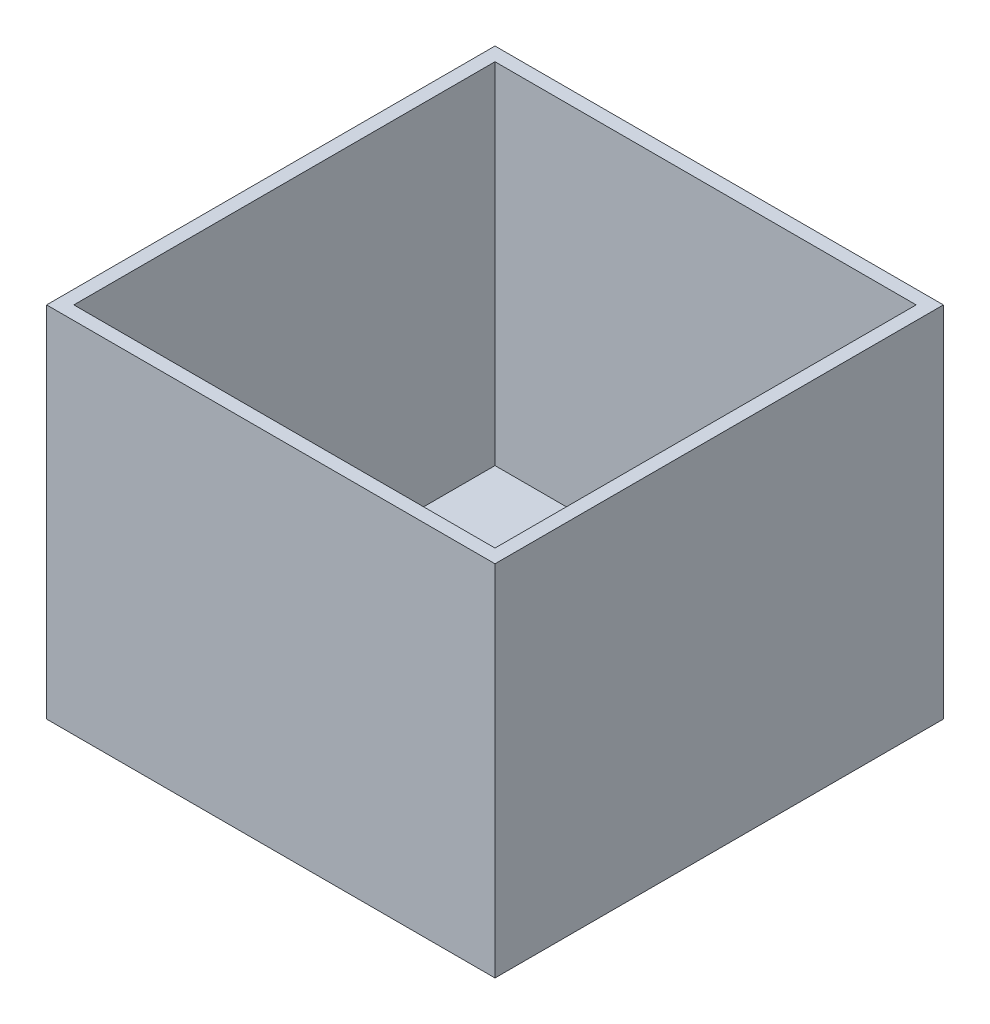
ISO-10303-21;
HEADER;
FILE_DESCRIPTION(('STEP AP214'),'2;1');
FILE_NAME('part.step','',(''),(''),'','','');
FILE_SCHEMA(('AUTOMOTIVE_DESIGN { 1 0 10303 214 1 1 1 1 }'));
ENDSEC;
DATA;
#1=APPLICATION_CONTEXT('core data for automotive mechanical design processes');
#2=APPLICATION_PROTOCOL_DEFINITION('international standard','automotive_design',2000,#1);
#3=PRODUCT_CONTEXT('',#1,'mechanical');
#4=PRODUCT('Part','Part','',(#3));
#5=PRODUCT_RELATED_PRODUCT_CATEGORY('part','',(#4));
#6=PRODUCT_DEFINITION_FORMATION('','',#4);
#7=PRODUCT_DEFINITION_CONTEXT('part definition',#1,'design');
#8=PRODUCT_DEFINITION('design','',#6,#7);
#9=PRODUCT_DEFINITION_SHAPE('','',#8);
#10=(LENGTH_UNIT() NAMED_UNIT(*) SI_UNIT(.MILLI.,.METRE.));
#11=(NAMED_UNIT(*) PLANE_ANGLE_UNIT() SI_UNIT($,.RADIAN.));
#12=(NAMED_UNIT(*) SI_UNIT($,.STERADIAN.) SOLID_ANGLE_UNIT());
#13=UNCERTAINTY_MEASURE_WITH_UNIT(LENGTH_MEASURE(1.E-05),#10,'distance_accuracy_value','');
#14=(GEOMETRIC_REPRESENTATION_CONTEXT(3) GLOBAL_UNCERTAINTY_ASSIGNED_CONTEXT((#13)) GLOBAL_UNIT_ASSIGNED_CONTEXT((#10,
#11,#12)) REPRESENTATION_CONTEXT('',''));
#15=CARTESIAN_POINT('',(0.,0.,0.));
#16=DIRECTION('',(0.,0.,1.));
#17=DIRECTION('',(1.,0.,0.));
#18=AXIS2_PLACEMENT_3D('',#15,#16,#17);
#19=CARTESIAN_POINT('',(250.,10.,-250.));
#20=DIRECTION('',(-1.,0.,0.));
#21=DIRECTION('',(0.,0.,1.));
#22=AXIS2_PLACEMENT_3D('',#19,#20,#21);
#23=PLANE('',#22);
#24=DIRECTION('',(0.,0.,-1.));
#25=VECTOR('',#24,1.);
#26=CARTESIAN_POINT('',(250.,0.,-250.));
#27=LINE('',#26,#25);
#28=CARTESIAN_POINT('',(250.,0.,250.));
#29=VERTEX_POINT('',#28);
#30=CARTESIAN_POINT('',(250.,0.,-250.));
#31=VERTEX_POINT('',#30);
#32=EDGE_CURVE('E147',#29,#31,#27,.T.);
#33=ORIENTED_EDGE('',*,*,#32,.T.);
#34=DIRECTION('',(0.,-1.,0.));
#35=VECTOR('',#34,1.);
#36=CARTESIAN_POINT('',(250.,10.,-250.));
#37=LINE('',#36,#35);
#38=CARTESIAN_POINT('',(250.,400.,-250.));
#39=VERTEX_POINT('',#38);
#40=EDGE_CURVE('E11',#39,#31,#37,.T.);
#41=ORIENTED_EDGE('',*,*,#40,.F.);
#42=DIRECTION('',(0.,0.,-1.));
#43=VECTOR('',#42,1.);
#44=CARTESIAN_POINT('',(250.,400.,250.));
#45=LINE('',#44,#43);
#46=CARTESIAN_POINT('',(250.,400.,250.));
#47=VERTEX_POINT('',#46);
#48=EDGE_CURVE('E112',#47,#39,#45,.T.);
#49=ORIENTED_EDGE('',*,*,#48,.F.);
#50=DIRECTION('',(0.,-1.,0.));
#51=VECTOR('',#50,1.);
#52=CARTESIAN_POINT('',(250.,10.,250.));
#53=LINE('',#52,#51);
#54=EDGE_CURVE('E156',#47,#29,#53,.T.);
#55=ORIENTED_EDGE('',*,*,#54,.T.);
#56=EDGE_LOOP('',(#33,#41,#49,#55));
#57=FACE_BOUND('',#56,.T.);
#58=ADVANCED_FACE('F34',(#57),#23,.F.);
#59=CARTESIAN_POINT('',(-250.,10.,-250.));
#60=DIRECTION('',(0.,0.,1.));
#61=DIRECTION('',(1.,0.,0.));
#62=AXIS2_PLACEMENT_3D('',#59,#60,#61);
#63=PLANE('',#62);
#64=DIRECTION('',(-1.,0.,0.));
#65=VECTOR('',#64,1.);
#66=CARTESIAN_POINT('',(-250.,0.,-250.));
#67=LINE('',#66,#65);
#68=CARTESIAN_POINT('',(-250.,0.,-250.));
#69=VERTEX_POINT('',#68);
#70=EDGE_CURVE('E150',#31,#69,#67,.T.);
#71=ORIENTED_EDGE('',*,*,#70,.T.);
#72=DIRECTION('',(0.,-1.,0.));
#73=VECTOR('',#72,1.);
#74=CARTESIAN_POINT('',(-250.,10.,-250.));
#75=LINE('',#74,#73);
#76=CARTESIAN_POINT('',(-250.,400.,-250.));
#77=VERTEX_POINT('',#76);
#78=EDGE_CURVE('E41',#77,#69,#75,.T.);
#79=ORIENTED_EDGE('',*,*,#78,.F.);
#80=DIRECTION('',(-1.,0.,0.));
#81=VECTOR('',#80,1.);
#82=CARTESIAN_POINT('',(-250.,400.,-250.));
#83=LINE('',#82,#81);
#84=EDGE_CURVE('E131',#39,#77,#83,.T.);
#85=ORIENTED_EDGE('',*,*,#84,.F.);
#86=ORIENTED_EDGE('',*,*,#40,.T.);
#87=EDGE_LOOP('',(#71,#79,#85,#86));
#88=FACE_BOUND('',#87,.T.);
#89=ADVANCED_FACE('F178',(#88),#63,.F.);
#90=CARTESIAN_POINT('',(-250.,10.,-250.));
#91=DIRECTION('',(1.,0.,0.));
#92=DIRECTION('',(0.,0.,-1.));
#93=AXIS2_PLACEMENT_3D('',#90,#91,#92);
#94=PLANE('',#93);
#95=DIRECTION('',(0.,0.,1.));
#96=VECTOR('',#95,1.);
#97=CARTESIAN_POINT('',(-250.,0.,-250.));
#98=LINE('',#97,#96);
#99=CARTESIAN_POINT('',(-250.,0.,250.));
#100=VERTEX_POINT('',#99);
#101=EDGE_CURVE('E152',#69,#100,#98,.T.);
#102=ORIENTED_EDGE('',*,*,#101,.T.);
#103=DIRECTION('',(0.,-1.,0.));
#104=VECTOR('',#103,1.);
#105=CARTESIAN_POINT('',(-250.,10.,250.));
#106=LINE('',#105,#104);
#107=CARTESIAN_POINT('',(-250.,400.,250.));
#108=VERTEX_POINT('',#107);
#109=EDGE_CURVE('E159',#108,#100,#106,.T.);
#110=ORIENTED_EDGE('',*,*,#109,.F.);
#111=DIRECTION('',(0.,0.,1.));
#112=VECTOR('',#111,1.);
#113=CARTESIAN_POINT('',(-250.,400.,250.));
#114=LINE('',#113,#112);
#115=EDGE_CURVE('E134',#77,#108,#114,.T.);
#116=ORIENTED_EDGE('',*,*,#115,.F.);
#117=ORIENTED_EDGE('',*,*,#78,.T.);
#118=EDGE_LOOP('',(#102,#110,#116,#117));
#119=FACE_BOUND('',#118,.T.);
#120=ADVANCED_FACE('F165',(#119),#94,.F.);
#121=CARTESIAN_POINT('',(-250.,10.,250.));
#122=DIRECTION('',(0.,0.,-1.));
#123=DIRECTION('',(-1.,0.,0.));
#124=AXIS2_PLACEMENT_3D('',#121,#122,#123);
#125=PLANE('',#124);
#126=DIRECTION('',(1.,0.,0.));
#127=VECTOR('',#126,1.);
#128=CARTESIAN_POINT('',(-250.,0.,250.));
#129=LINE('',#128,#127);
#130=EDGE_CURVE('E154',#100,#29,#129,.T.);
#131=ORIENTED_EDGE('',*,*,#130,.T.);
#132=ORIENTED_EDGE('',*,*,#54,.F.);
#133=DIRECTION('',(1.,0.,0.));
#134=VECTOR('',#133,1.);
#135=CARTESIAN_POINT('',(-250.,400.,250.));
#136=LINE('',#135,#134);
#137=EDGE_CURVE('E137',#108,#47,#136,.T.);
#138=ORIENTED_EDGE('',*,*,#137,.F.);
#139=ORIENTED_EDGE('',*,*,#109,.T.);
#140=EDGE_LOOP('',(#131,#132,#138,#139));
#141=FACE_BOUND('',#140,.T.);
#142=ADVANCED_FACE('F173',(#141),#125,.F.);
#143=CARTESIAN_POINT('',(0.,0.,0.));
#144=DIRECTION('',(0.,1.,0.));
#145=DIRECTION('',(0.,0.,1.));
#146=AXIS2_PLACEMENT_3D('',#143,#144,#145);
#147=PLANE('',#146);
#148=ORIENTED_EDGE('',*,*,#32,.F.);
#149=ORIENTED_EDGE('',*,*,#130,.F.);
#150=ORIENTED_EDGE('',*,*,#101,.F.);
#151=ORIENTED_EDGE('',*,*,#70,.F.);
#152=EDGE_LOOP('',(#148,#149,#150,#151));
#153=FACE_BOUND('',#152,.T.);
#154=ADVANCED_FACE('F171',(#153),#147,.F.);
#155=CARTESIAN_POINT('',(0.,400.,0.));
#156=DIRECTION('',(0.,-1.,0.));
#157=DIRECTION('',(0.,0.,-1.));
#158=AXIS2_PLACEMENT_3D('',#155,#156,#157);
#159=PLANE('',#158);
#160=ORIENTED_EDGE('',*,*,#48,.T.);
#161=ORIENTED_EDGE('',*,*,#84,.T.);
#162=ORIENTED_EDGE('',*,*,#115,.T.);
#163=ORIENTED_EDGE('',*,*,#137,.T.);
#164=EDGE_LOOP('',(#160,#161,#162,#163));
#165=FACE_BOUND('',#164,.T.);
#166=DIRECTION('',(0.,0.,-1.));
#167=VECTOR('',#166,1.);
#168=CARTESIAN_POINT('',(234.807231681986,400.,234.807231681986));
#169=LINE('',#168,#167);
#170=CARTESIAN_POINT('',(234.807231681986,400.,234.807231681986));
#171=VERTEX_POINT('',#170);
#172=CARTESIAN_POINT('',(234.807231681986,400.,-234.807231681986));
#173=VERTEX_POINT('',#172);
#174=EDGE_CURVE('E97',#171,#173,#169,.T.);
#175=ORIENTED_EDGE('',*,*,#174,.F.);
#176=DIRECTION('',(1.,0.,0.));
#177=VECTOR('',#176,1.);
#178=CARTESIAN_POINT('',(-234.807231681986,400.,234.807231681986));
#179=LINE('',#178,#177);
#180=CARTESIAN_POINT('',(-234.807231681986,400.,234.807231681986));
#181=VERTEX_POINT('',#180);
#182=EDGE_CURVE('E120',#181,#171,#179,.T.);
#183=ORIENTED_EDGE('',*,*,#182,.F.);
#184=DIRECTION('',(0.,0.,1.));
#185=VECTOR('',#184,1.);
#186=CARTESIAN_POINT('',(-234.807231681986,400.,234.807231681986));
#187=LINE('',#186,#185);
#188=CARTESIAN_POINT('',(-234.807231681986,400.,-234.807231681986));
#189=VERTEX_POINT('',#188);
#190=EDGE_CURVE('E118',#189,#181,#187,.T.);
#191=ORIENTED_EDGE('',*,*,#190,.F.);
#192=DIRECTION('',(-1.,0.,0.));
#193=VECTOR('',#192,1.);
#194=CARTESIAN_POINT('',(-234.807231681986,400.,-234.807231681986));
#195=LINE('',#194,#193);
#196=EDGE_CURVE('E106',#173,#189,#195,.T.);
#197=ORIENTED_EDGE('',*,*,#196,.F.);
#198=EDGE_LOOP('',(#175,#183,#191,#197));
#199=FACE_BOUND('',#198,.T.);
#200=ADVANCED_FACE('F116',(#165,#199),#159,.F.);
#201=CARTESIAN_POINT('',(234.807231681986,400.,234.807231681986));
#202=DIRECTION('',(-1.,0.,0.));
#203=DIRECTION('',(0.,0.,1.));
#204=AXIS2_PLACEMENT_3D('',#201,#202,#203);
#205=PLANE('',#204);
#206=DIRECTION('',(0.,-1.,0.));
#207=VECTOR('',#206,1.);
#208=CARTESIAN_POINT('',(234.807231681986,400.,-234.807231681986));
#209=LINE('',#208,#207);
#210=CARTESIAN_POINT('',(234.807231681986,10.,-234.807231681986));
#211=VERTEX_POINT('',#210);
#212=EDGE_CURVE('E100',#173,#211,#209,.T.);
#213=ORIENTED_EDGE('',*,*,#212,.T.);
#214=DIRECTION('',(0.,0.,1.));
#215=VECTOR('',#214,1.);
#216=CARTESIAN_POINT('',(234.807231681986,10.,0.));
#217=LINE('',#216,#215);
#218=CARTESIAN_POINT('',(234.807231681986,10.,234.807231681986));
#219=VERTEX_POINT('',#218);
#220=EDGE_CURVE('E48',#211,#219,#217,.T.);
#221=ORIENTED_EDGE('',*,*,#220,.T.);
#222=DIRECTION('',(0.,-1.,0.));
#223=VECTOR('',#222,1.);
#224=CARTESIAN_POINT('',(234.807231681986,400.,234.807231681986));
#225=LINE('',#224,#223);
#226=EDGE_CURVE('E102',#171,#219,#225,.T.);
#227=ORIENTED_EDGE('',*,*,#226,.F.);
#228=ORIENTED_EDGE('',*,*,#174,.T.);
#229=EDGE_LOOP('',(#213,#221,#227,#228));
#230=FACE_BOUND('',#229,.T.);
#231=ADVANCED_FACE('F99',(#230),#205,.T.);
#232=CARTESIAN_POINT('',(-234.807231681986,400.,-234.807231681986));
#233=DIRECTION('',(0.,0.,1.));
#234=DIRECTION('',(1.,0.,0.));
#235=AXIS2_PLACEMENT_3D('',#232,#233,#234);
#236=PLANE('',#235);
#237=DIRECTION('',(0.,-1.,0.));
#238=VECTOR('',#237,1.);
#239=CARTESIAN_POINT('',(-234.807231681986,400.,-234.807231681986));
#240=LINE('',#239,#238);
#241=CARTESIAN_POINT('',(-234.807231681986,10.,-234.807231681986));
#242=VERTEX_POINT('',#241);
#243=EDGE_CURVE('E113',#189,#242,#240,.T.);
#244=ORIENTED_EDGE('',*,*,#243,.T.);
#245=DIRECTION('',(1.,0.,0.));
#246=VECTOR('',#245,1.);
#247=CARTESIAN_POINT('',(0.,10.,-234.807231681986));
#248=LINE('',#247,#246);
#249=EDGE_CURVE('E52',#242,#211,#248,.T.);
#250=ORIENTED_EDGE('',*,*,#249,.T.);
#251=ORIENTED_EDGE('',*,*,#212,.F.);
#252=ORIENTED_EDGE('',*,*,#196,.T.);
#253=EDGE_LOOP('',(#244,#250,#251,#252));
#254=FACE_BOUND('',#253,.T.);
#255=ADVANCED_FACE('F110',(#254),#236,.T.);
#256=CARTESIAN_POINT('',(-234.807231681986,400.,234.807231681986));
#257=DIRECTION('',(1.,0.,0.));
#258=DIRECTION('',(0.,0.,-1.));
#259=AXIS2_PLACEMENT_3D('',#256,#257,#258);
#260=PLANE('',#259);
#261=DIRECTION('',(0.,-1.,0.));
#262=VECTOR('',#261,1.);
#263=CARTESIAN_POINT('',(-234.807231681986,400.,234.807231681986));
#264=LINE('',#263,#262);
#265=CARTESIAN_POINT('',(-234.807231681986,10.,234.807231681986));
#266=VERTEX_POINT('',#265);
#267=EDGE_CURVE('E125',#181,#266,#264,.T.);
#268=ORIENTED_EDGE('',*,*,#267,.T.);
#269=DIRECTION('',(0.,0.,-1.));
#270=VECTOR('',#269,1.);
#271=CARTESIAN_POINT('',(-234.807231681986,10.,0.));
#272=LINE('',#271,#270);
#273=EDGE_CURVE('E143',#266,#242,#272,.T.);
#274=ORIENTED_EDGE('',*,*,#273,.T.);
#275=ORIENTED_EDGE('',*,*,#243,.F.);
#276=ORIENTED_EDGE('',*,*,#190,.T.);
#277=EDGE_LOOP('',(#268,#274,#275,#276));
#278=FACE_BOUND('',#277,.T.);
#279=ADVANCED_FACE('F200',(#278),#260,.T.);
#280=CARTESIAN_POINT('',(-234.807231681986,400.,234.807231681986));
#281=DIRECTION('',(0.,0.,-1.));
#282=DIRECTION('',(-1.,0.,0.));
#283=AXIS2_PLACEMENT_3D('',#280,#281,#282);
#284=PLANE('',#283);
#285=ORIENTED_EDGE('',*,*,#226,.T.);
#286=DIRECTION('',(-1.,0.,0.));
#287=VECTOR('',#286,1.);
#288=CARTESIAN_POINT('',(0.,10.,234.807231681986));
#289=LINE('',#288,#287);
#290=EDGE_CURVE('E140',#219,#266,#289,.T.);
#291=ORIENTED_EDGE('',*,*,#290,.T.);
#292=ORIENTED_EDGE('',*,*,#267,.F.);
#293=ORIENTED_EDGE('',*,*,#182,.T.);
#294=EDGE_LOOP('',(#285,#291,#292,#293));
#295=FACE_BOUND('',#294,.T.);
#296=ADVANCED_FACE('F193',(#295),#284,.T.);
#297=CARTESIAN_POINT('',(0.,10.,0.));
#298=DIRECTION('',(0.,1.,0.));
#299=DIRECTION('',(0.,0.,1.));
#300=AXIS2_PLACEMENT_3D('',#297,#298,#299);
#301=PLANE('',#300);
#302=ORIENTED_EDGE('',*,*,#220,.F.);
#303=ORIENTED_EDGE('',*,*,#249,.F.);
#304=ORIENTED_EDGE('',*,*,#273,.F.);
#305=ORIENTED_EDGE('',*,*,#290,.F.);
#306=EDGE_LOOP('',(#302,#303,#304,#305));
#307=FACE_BOUND('',#306,.T.);
#308=ADVANCED_FACE('F190',(#307),#301,.T.);
#309=CLOSED_SHELL('',(#58,#89,#120,#142,#154,#200,#231,#255,#279,#296,#308));
#310=MANIFOLD_SOLID_BREP('B2',#309);
#311=ADVANCED_BREP_SHAPE_REPRESENTATION('',(#18,#310),#14);
#312=SHAPE_DEFINITION_REPRESENTATION(#9,#311);
ENDSEC;
END-ISO-10303-21;
